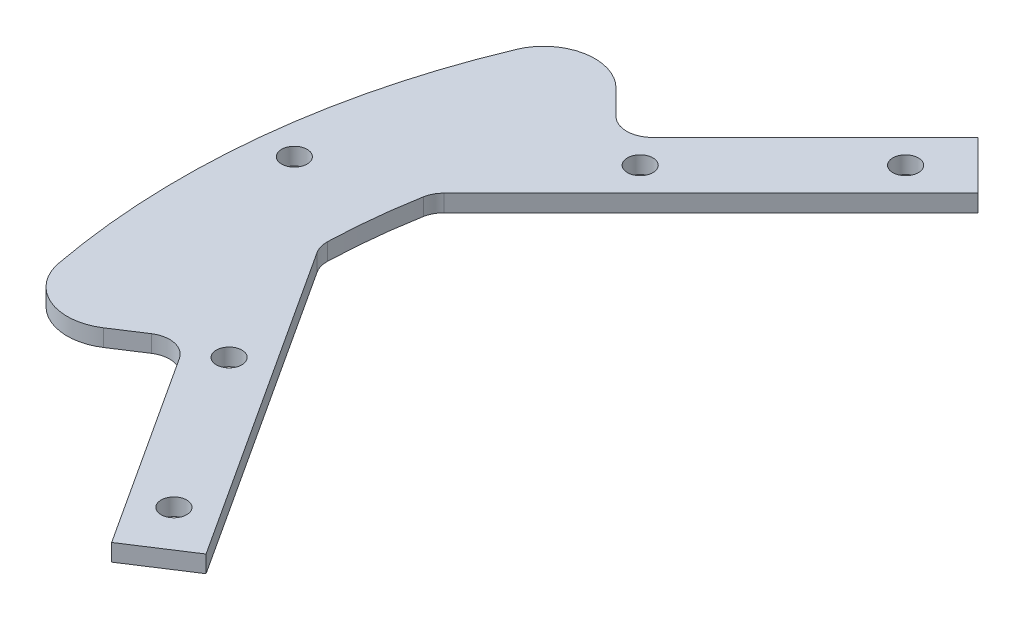
ISO-10303-21;
HEADER;
FILE_DESCRIPTION(('STEP AP214'),'2;1');
FILE_NAME('part.step','',(''),(''),'','','');
FILE_SCHEMA(('AUTOMOTIVE_DESIGN { 1 0 10303 214 1 1 1 1 }'));
ENDSEC;
DATA;
#1=APPLICATION_CONTEXT('core data for automotive mechanical design processes');
#2=APPLICATION_PROTOCOL_DEFINITION('international standard','automotive_design',2000,#1);
#3=PRODUCT_CONTEXT('',#1,'mechanical');
#4=PRODUCT('Part','Part','',(#3));
#5=PRODUCT_RELATED_PRODUCT_CATEGORY('part','',(#4));
#6=PRODUCT_DEFINITION_FORMATION('','',#4);
#7=PRODUCT_DEFINITION_CONTEXT('part definition',#1,'design');
#8=PRODUCT_DEFINITION('design','',#6,#7);
#9=PRODUCT_DEFINITION_SHAPE('','',#8);
#10=(LENGTH_UNIT() NAMED_UNIT(*) SI_UNIT(.MILLI.,.METRE.));
#11=(NAMED_UNIT(*) PLANE_ANGLE_UNIT() SI_UNIT($,.RADIAN.));
#12=(NAMED_UNIT(*) SI_UNIT($,.STERADIAN.) SOLID_ANGLE_UNIT());
#13=UNCERTAINTY_MEASURE_WITH_UNIT(LENGTH_MEASURE(1.E-05),#10,'distance_accuracy_value','');
#14=(GEOMETRIC_REPRESENTATION_CONTEXT(3) GLOBAL_UNCERTAINTY_ASSIGNED_CONTEXT((#13)) GLOBAL_UNIT_ASSIGNED_CONTEXT((#10,
#11,#12)) REPRESENTATION_CONTEXT('',''));
#15=CARTESIAN_POINT('',(0.,0.,0.));
#16=DIRECTION('',(0.,0.,1.));
#17=DIRECTION('',(1.,0.,0.));
#18=AXIS2_PLACEMENT_3D('',#15,#16,#17);
#19=CARTESIAN_POINT('',(0.,2.,0.));
#20=DIRECTION('',(0.,1.,0.));
#21=DIRECTION('',(0.,0.,1.));
#22=AXIS2_PLACEMENT_3D('',#19,#20,#21);
#23=PLANE('',#22);
#24=CARTESIAN_POINT('',(-80.5343611063032,2.,-8.8849193777506));
#25=DIRECTION('',(0.,1.,0.));
#26=DIRECTION('',(0.,0.,1.));
#27=AXIS2_PLACEMENT_3D('',#24,#25,#26);
#28=CIRCLE('',#27,1.5);
#29=CARTESIAN_POINT('',(-80.5343611063032,2.,-7.3849193777506));
#30=VERTEX_POINT('',#29);
#31=EDGE_CURVE('E550',#30,#30,#28,.T.);
#32=ORIENTED_EDGE('',*,*,#31,.F.);
#33=EDGE_LOOP('',(#32));
#34=FACE_BOUND('',#33,.T.);
#35=CARTESIAN_POINT('',(-51.9975752126165,2.,33.7676201709314));
#36=DIRECTION('',(0.,1.,0.));
#37=DIRECTION('',(0.,0.,1.));
#38=AXIS2_PLACEMENT_3D('',#35,#36,#37);
#39=CIRCLE('',#38,1.5);
#40=CARTESIAN_POINT('',(-51.9975752126165,2.,35.2676201709314));
#41=VERTEX_POINT('',#40);
#42=EDGE_CURVE('E533',#41,#41,#39,.T.);
#43=ORIENTED_EDGE('',*,*,#42,.F.);
#44=EDGE_LOOP('',(#43));
#45=FACE_BOUND('',#44,.T.);
#46=CARTESIAN_POINT('',(-43.8406204335662,2.,-43.8406204335657));
#47=DIRECTION('',(0.,1.,0.));
#48=DIRECTION('',(0.,0.,1.));
#49=AXIS2_PLACEMENT_3D('',#46,#47,#48);
#50=CIRCLE('',#49,1.5);
#51=CARTESIAN_POINT('',(-43.8406204335662,2.,-42.3406204335657));
#52=VERTEX_POINT('',#51);
#53=EDGE_CURVE('E192',#52,#52,#50,.T.);
#54=ORIENTED_EDGE('',*,*,#53,.F.);
#55=EDGE_LOOP('',(#54));
#56=FACE_BOUND('',#55,.T.);
#57=DIRECTION('',(-0.707106781186544,0.,0.707106781186551));
#58=VECTOR('',#57,1.);
#59=CARTESIAN_POINT('',(-63.6396103067894,2.,-29.6984848098347));
#60=LINE('',#59,#58);
#61=CARTESIAN_POINT('',(-42.4264068711931,2.,-50.9116882454312));
#62=VERTEX_POINT('',#61);
#63=CARTESIAN_POINT('',(-61.5182899632298,2.,-31.8198051533943));
#64=VERTEX_POINT('',#63);
#65=EDGE_CURVE('E183',#62,#64,#60,.T.);
#66=ORIENTED_EDGE('',*,*,#65,.T.);
#67=CARTESIAN_POINT('',(-63.6396103067894,2.,-33.941125496954));
#68=DIRECTION('',(0.,1.,0.));
#69=DIRECTION('',(0.,0.,1.));
#70=AXIS2_PLACEMENT_3D('',#67,#68,#69);
#71=CIRCLE('',#70,3.);
#72=CARTESIAN_POINT('',(-65.7609306503491,2.,-31.8198051533943));
#73=VERTEX_POINT('',#72);
#74=EDGE_CURVE('E266',#64,#73,#71,.F.);
#75=ORIENTED_EDGE('',*,*,#74,.T.);
#76=DIRECTION('',(-0.707106781186552,0.,-0.707106781186543));
#77=VECTOR('',#76,1.);
#78=CARTESIAN_POINT('',(-74.6290400089809,2.,-40.687914512026));
#79=LINE('',#78,#77);
#80=CARTESIAN_POINT('',(-68.6474434592942,2.,-34.7063179623394));
#81=VERTEX_POINT('',#80);
#82=EDGE_CURVE('E185',#73,#81,#79,.T.);
#83=ORIENTED_EDGE('',*,*,#82,.T.);
#84=CARTESIAN_POINT('',(-72.8900841464135,2.,-30.4636772752201));
#85=DIRECTION('',(0.,1.,0.));
#86=DIRECTION('',(0.,0.,1.));
#87=AXIS2_PLACEMENT_3D('',#84,#85,#86);
#88=CIRCLE('',#87,6.);
#89=CARTESIAN_POINT('',(-78.4260399043689,2.,-32.7773742834647));
#90=VERTEX_POINT('',#89);
#91=EDGE_CURVE('E233',#81,#90,#88,.T.);
#92=ORIENTED_EDGE('',*,*,#91,.T.);
#93=CARTESIAN_POINT('',(0.,2.,0.));
#94=DIRECTION('',(0.,1.,0.));
#95=DIRECTION('',(0.,0.,1.));
#96=AXIS2_PLACEMENT_3D('',#93,#94,#95);
#97=CIRCLE('',#96,85.);
#98=CARTESIAN_POINT('',(-83.5270420753539,2.,15.7554194530665));
#99=VERTEX_POINT('',#98);
#100=EDGE_CURVE('E212',#90,#99,#97,.T.);
#101=ORIENTED_EDGE('',*,*,#100,.T.);
#102=CARTESIAN_POINT('',(-77.6310155759171,2.,14.6432721975559));
#103=DIRECTION('',(0.,1.,0.));
#104=DIRECTION('',(0.,0.,1.));
#105=AXIS2_PLACEMENT_3D('',#102,#103,#104);
#106=CIRCLE('',#105,6.);
#107=CARTESIAN_POINT('',(-74.363181365827,2.,19.6752956052285));
#108=VERTEX_POINT('',#107);
#109=EDGE_CURVE('E231',#99,#108,#106,.T.);
#110=ORIENTED_EDGE('',*,*,#109,.T.);
#111=DIRECTION('',(0.838670567945427,0.,-0.544639035015022));
#112=VECTOR('',#111,1.);
#113=CARTESIAN_POINT('',(-68.4235943247587,2.,15.8180826803013));
#114=LINE('',#113,#112);
#115=CARTESIAN_POINT('',(-70.939606028595,2.,17.4519997853463));
#116=VERTEX_POINT('',#115);
#117=EDGE_CURVE('E157',#108,#116,#114,.T.);
#118=ORIENTED_EDGE('',*,*,#117,.T.);
#119=CARTESIAN_POINT('',(-69.3056889235499,2.,19.9680114891826));
#120=DIRECTION('',(0.,1.,0.));
#121=DIRECTION('',(0.,0.,1.));
#122=AXIS2_PLACEMENT_3D('',#119,#120,#121);
#123=CIRCLE('',#122,3.);
#124=CARTESIAN_POINT('',(-66.7896772197137,2.,18.3340943841376));
#125=VERTEX_POINT('',#124);
#126=EDGE_CURVE('E11',#116,#125,#123,.F.);
#127=ORIENTED_EDGE('',*,*,#126,.T.);
#128=DIRECTION('',(0.544639035015023,0.,0.838670567945427));
#129=VECTOR('',#128,1.);
#130=CARTESIAN_POINT('',(-52.0844232743081,2.,40.978199718664));
#131=LINE('',#130,#129);
#132=CARTESIAN_POINT('',(-52.0844232743081,2.,40.978199718664));
#133=VERTEX_POINT('',#132);
#134=EDGE_CURVE('E145',#125,#133,#131,.T.);
#135=ORIENTED_EDGE('',*,*,#134,.T.);
#136=DIRECTION('',(0.838670567945427,0.,-0.544639035015022));
#137=VECTOR('',#136,1.);
#138=CARTESIAN_POINT('',(-45.3750587307446,2.,36.6210874385439));
#139=LINE('',#138,#137);
#140=CARTESIAN_POINT('',(-45.3750587307446,2.,36.6210874385439));
#141=VERTEX_POINT('',#140);
#142=EDGE_CURVE('E151',#133,#141,#139,.T.);
#143=ORIENTED_EDGE('',*,*,#142,.T.);
#144=DIRECTION('',(-0.544639035015023,0.,-0.838670567945426));
#145=VECTOR('',#144,1.);
#146=CARTESIAN_POINT('',(-69.9882966174528,2.,-1.27997522923208));
#147=LINE('',#146,#145);
#148=CARTESIAN_POINT('',(-69.4820094592601,2.,-0.500361372701874));
#149=VERTEX_POINT('',#148);
#150=EDGE_CURVE('E171',#141,#149,#147,.T.);
#151=ORIENTED_EDGE('',*,*,#150,.T.);
#152=CARTESIAN_POINT('',(-66.9659977554238,2.,-2.13427847774693));
#153=DIRECTION('',(0.,1.,0.));
#154=DIRECTION('',(0.,0.,1.));
#155=AXIS2_PLACEMENT_3D('',#152,#153,#154);
#156=CIRCLE('',#155,3.);
#157=CARTESIAN_POINT('',(-69.9644752668607,2.,-2.22984318570575));
#158=VERTEX_POINT('',#157);
#159=EDGE_CURVE('E258',#149,#158,#156,.F.);
#160=ORIENTED_EDGE('',*,*,#159,.T.);
#161=CARTESIAN_POINT('',(0.,2.,0.));
#162=DIRECTION('',(0.,-1.,0.));
#163=DIRECTION('',(0.,0.,1.));
#164=AXIS2_PLACEMENT_3D('',#161,#162,#163);
#165=CIRCLE('',#164,70.);
#166=CARTESIAN_POINT('',(-68.899194085878,2.,-12.3653165877995));
#167=VERTEX_POINT('',#166);
#168=EDGE_CURVE('E173',#158,#167,#165,.T.);
#169=ORIENTED_EDGE('',*,*,#168,.T.);
#170=CARTESIAN_POINT('',(-65.9463714821975,2.,-11.8353744483224));
#171=DIRECTION('',(0.,1.,0.));
#172=DIRECTION('',(0.,0.,1.));
#173=AXIS2_PLACEMENT_3D('',#170,#171,#172);
#174=CIRCLE('',#173,3.);
#175=CARTESIAN_POINT('',(-68.0676918257572,2.,-13.956694791882));
#176=VERTEX_POINT('',#175);
#177=EDGE_CURVE('E262',#167,#176,#174,.F.);
#178=ORIENTED_EDGE('',*,*,#177,.T.);
#179=DIRECTION('',(0.707106781186543,0.,-0.707106781186551));
#180=VECTOR('',#179,1.);
#181=CARTESIAN_POINT('',(-36.7695526217007,2.,-45.2548339959388));
#182=LINE('',#181,#180);
#183=CARTESIAN_POINT('',(-36.7695526217007,2.,-45.2548339959388));
#184=VERTEX_POINT('',#183);
#185=EDGE_CURVE('E179',#176,#184,#182,.T.);
#186=ORIENTED_EDGE('',*,*,#185,.T.);
#187=DIRECTION('',(-0.707106781186551,0.,-0.707106781186544));
#188=VECTOR('',#187,1.);
#189=CARTESIAN_POINT('',(-42.4264068711931,2.,-50.9116882454312));
#190=LINE('',#189,#188);
#191=EDGE_CURVE('E181',#184,#62,#190,.T.);
#192=ORIENTED_EDGE('',*,*,#191,.T.);
#193=EDGE_LOOP('',(#66,#75,#83,#92,#101,#110,#118,#127,#135,#143,#151,#160,#169,#178,#186,#192));
#194=FACE_BOUND('',#193,.T.);
#195=CARTESIAN_POINT('',(-59.3969696196702,2.,-28.2842712474616));
#196=DIRECTION('',(0.,1.,0.));
#197=DIRECTION('',(0.,0.,1.));
#198=AXIS2_PLACEMENT_3D('',#195,#196,#197);
#199=CIRCLE('',#198,1.5);
#200=CARTESIAN_POINT('',(-59.3969696196702,2.,-26.7842712474616));
#201=VERTEX_POINT('',#200);
#202=EDGE_CURVE('E527',#201,#201,#199,.T.);
#203=ORIENTED_EDGE('',*,*,#202,.F.);
#204=EDGE_LOOP('',(#203));
#205=FACE_BOUND('',#204,.T.);
#206=CARTESIAN_POINT('',(-63.979633982947,2.,15.316867676132));
#207=DIRECTION('',(0.,1.,0.));
#208=DIRECTION('',(0.,0.,1.));
#209=AXIS2_PLACEMENT_3D('',#206,#207,#208);
#210=CIRCLE('',#209,1.5);
#211=CARTESIAN_POINT('',(-63.979633982947,2.,16.816867676132));
#212=VERTEX_POINT('',#211);
#213=EDGE_CURVE('E539',#212,#212,#210,.T.);
#214=ORIENTED_EDGE('',*,*,#213,.F.);
#215=EDGE_LOOP('',(#214));
#216=FACE_BOUND('',#215,.T.);
#217=ADVANCED_FACE('F33',(#34,#45,#56,#194,#205,#216),#23,.T.);
#218=CARTESIAN_POINT('',(0.,0.,0.));
#219=DIRECTION('',(0.,1.,0.));
#220=DIRECTION('',(0.,0.,1.));
#221=AXIS2_PLACEMENT_3D('',#218,#219,#220);
#222=PLANE('',#221);
#223=CARTESIAN_POINT('',(-80.5343611063032,0.,-8.8849193777506));
#224=DIRECTION('',(0.,1.,0.));
#225=DIRECTION('',(0.,0.,1.));
#226=AXIS2_PLACEMENT_3D('',#223,#224,#225);
#227=CIRCLE('',#226,1.5);
#228=CARTESIAN_POINT('',(-80.5343611063032,0.,-7.3849193777506));
#229=VERTEX_POINT('',#228);
#230=EDGE_CURVE('E545',#229,#229,#227,.T.);
#231=ORIENTED_EDGE('',*,*,#230,.T.);
#232=EDGE_LOOP('',(#231));
#233=FACE_BOUND('',#232,.T.);
#234=CARTESIAN_POINT('',(-51.9975752126165,0.,33.7676201709314));
#235=DIRECTION('',(0.,1.,0.));
#236=DIRECTION('',(0.,0.,1.));
#237=AXIS2_PLACEMENT_3D('',#234,#235,#236);
#238=CIRCLE('',#237,1.5);
#239=CARTESIAN_POINT('',(-51.9975752126165,0.,35.2676201709314));
#240=VERTEX_POINT('',#239);
#241=EDGE_CURVE('E536',#240,#240,#238,.T.);
#242=ORIENTED_EDGE('',*,*,#241,.T.);
#243=EDGE_LOOP('',(#242));
#244=FACE_BOUND('',#243,.T.);
#245=CARTESIAN_POINT('',(-43.8406204335662,0.,-43.8406204335657));
#246=DIRECTION('',(0.,1.,0.));
#247=DIRECTION('',(0.,0.,1.));
#248=AXIS2_PLACEMENT_3D('',#245,#246,#247);
#249=CIRCLE('',#248,1.5);
#250=CARTESIAN_POINT('',(-43.8406204335662,0.,-42.3406204335657));
#251=VERTEX_POINT('',#250);
#252=EDGE_CURVE('E524',#251,#251,#249,.T.);
#253=ORIENTED_EDGE('',*,*,#252,.T.);
#254=EDGE_LOOP('',(#253));
#255=FACE_BOUND('',#254,.T.);
#256=CARTESIAN_POINT('',(0.,0.,0.));
#257=DIRECTION('',(0.,1.,0.));
#258=DIRECTION('',(0.,0.,1.));
#259=AXIS2_PLACEMENT_3D('',#256,#257,#258);
#260=CIRCLE('',#259,85.);
#261=CARTESIAN_POINT('',(-78.4260399043689,0.,-32.7773742834647));
#262=VERTEX_POINT('',#261);
#263=CARTESIAN_POINT('',(-83.5270420753539,0.,15.7554194530665));
#264=VERTEX_POINT('',#263);
#265=EDGE_CURVE('E188',#262,#264,#260,.T.);
#266=ORIENTED_EDGE('',*,*,#265,.F.);
#267=CARTESIAN_POINT('',(-72.8900841464135,0.,-30.4636772752201));
#268=DIRECTION('',(0.,1.,0.));
#269=DIRECTION('',(0.,0.,1.));
#270=AXIS2_PLACEMENT_3D('',#267,#268,#269);
#271=CIRCLE('',#270,6.);
#272=CARTESIAN_POINT('',(-68.6474434592942,0.,-34.7063179623394));
#273=VERTEX_POINT('',#272);
#274=EDGE_CURVE('E225',#262,#273,#271,.F.);
#275=ORIENTED_EDGE('',*,*,#274,.T.);
#276=DIRECTION('',(-0.707106781186552,0.,-0.707106781186543));
#277=VECTOR('',#276,1.);
#278=CARTESIAN_POINT('',(-74.6290400089809,0.,-40.687914512026));
#279=LINE('',#278,#277);
#280=CARTESIAN_POINT('',(-65.7609306503491,0.,-31.8198051533943));
#281=VERTEX_POINT('',#280);
#282=EDGE_CURVE('E210',#281,#273,#279,.T.);
#283=ORIENTED_EDGE('',*,*,#282,.F.);
#284=CARTESIAN_POINT('',(-63.6396103067894,0.,-33.941125496954));
#285=DIRECTION('',(0.,1.,0.));
#286=DIRECTION('',(0.,0.,1.));
#287=AXIS2_PLACEMENT_3D('',#284,#285,#286);
#288=CIRCLE('',#287,3.);
#289=CARTESIAN_POINT('',(-61.5182899632298,0.,-31.8198051533943));
#290=VERTEX_POINT('',#289);
#291=EDGE_CURVE('E264',#281,#290,#288,.T.);
#292=ORIENTED_EDGE('',*,*,#291,.T.);
#293=DIRECTION('',(-0.707106781186544,0.,0.707106781186551));
#294=VECTOR('',#293,1.);
#295=CARTESIAN_POINT('',(-63.6396103067894,0.,-29.6984848098347));
#296=LINE('',#295,#294);
#297=CARTESIAN_POINT('',(-42.4264068711931,0.,-50.9116882454312));
#298=VERTEX_POINT('',#297);
#299=EDGE_CURVE('E207',#298,#290,#296,.T.);
#300=ORIENTED_EDGE('',*,*,#299,.F.);
#301=DIRECTION('',(-0.707106781186551,0.,-0.707106781186544));
#302=VECTOR('',#301,1.);
#303=CARTESIAN_POINT('',(-42.4264068711931,0.,-50.9116882454312));
#304=LINE('',#303,#302);
#305=CARTESIAN_POINT('',(-36.7695526217007,0.,-45.2548339959388));
#306=VERTEX_POINT('',#305);
#307=EDGE_CURVE('E205',#306,#298,#304,.T.);
#308=ORIENTED_EDGE('',*,*,#307,.F.);
#309=DIRECTION('',(0.707106781186543,0.,-0.707106781186551));
#310=VECTOR('',#309,1.);
#311=CARTESIAN_POINT('',(-36.7695526217007,0.,-45.2548339959388));
#312=LINE('',#311,#310);
#313=CARTESIAN_POINT('',(-68.0676918257572,0.,-13.956694791882));
#314=VERTEX_POINT('',#313);
#315=EDGE_CURVE('E203',#314,#306,#312,.T.);
#316=ORIENTED_EDGE('',*,*,#315,.F.);
#317=CARTESIAN_POINT('',(-65.9463714821975,0.,-11.8353744483224));
#318=DIRECTION('',(0.,1.,0.));
#319=DIRECTION('',(0.,0.,1.));
#320=AXIS2_PLACEMENT_3D('',#317,#318,#319);
#321=CIRCLE('',#320,3.);
#322=CARTESIAN_POINT('',(-68.899194085878,0.,-12.3653165877995));
#323=VERTEX_POINT('',#322);
#324=EDGE_CURVE('E260',#314,#323,#321,.T.);
#325=ORIENTED_EDGE('',*,*,#324,.T.);
#326=CARTESIAN_POINT('',(0.,0.,0.));
#327=DIRECTION('',(0.,-1.,0.));
#328=DIRECTION('',(0.,0.,1.));
#329=AXIS2_PLACEMENT_3D('',#326,#327,#328);
#330=CIRCLE('',#329,70.);
#331=CARTESIAN_POINT('',(-69.9644752668607,0.,-2.22984318570575));
#332=VERTEX_POINT('',#331);
#333=EDGE_CURVE('E200',#332,#323,#330,.T.);
#334=ORIENTED_EDGE('',*,*,#333,.F.);
#335=CARTESIAN_POINT('',(-66.9659977554238,0.,-2.13427847774693));
#336=DIRECTION('',(0.,1.,0.));
#337=DIRECTION('',(0.,0.,1.));
#338=AXIS2_PLACEMENT_3D('',#335,#336,#337);
#339=CIRCLE('',#338,3.);
#340=CARTESIAN_POINT('',(-69.4820094592601,0.,-0.500361372701874));
#341=VERTEX_POINT('',#340);
#342=EDGE_CURVE('E256',#332,#341,#339,.T.);
#343=ORIENTED_EDGE('',*,*,#342,.T.);
#344=DIRECTION('',(-0.544639035015023,0.,-0.838670567945426));
#345=VECTOR('',#344,1.);
#346=CARTESIAN_POINT('',(-69.9882966174528,0.,-1.27997522923208));
#347=LINE('',#346,#345);
#348=CARTESIAN_POINT('',(-45.3750587307446,0.,36.6210874385439));
#349=VERTEX_POINT('',#348);
#350=EDGE_CURVE('E197',#349,#341,#347,.T.);
#351=ORIENTED_EDGE('',*,*,#350,.F.);
#352=DIRECTION('',(0.838670567945427,0.,-0.544639035015022));
#353=VECTOR('',#352,1.);
#354=CARTESIAN_POINT('',(-45.3750587307446,0.,36.6210874385439));
#355=LINE('',#354,#353);
#356=CARTESIAN_POINT('',(-52.0844232743081,0.,40.978199718664));
#357=VERTEX_POINT('',#356);
#358=EDGE_CURVE('E195',#357,#349,#355,.T.);
#359=ORIENTED_EDGE('',*,*,#358,.F.);
#360=DIRECTION('',(0.544639035015023,0.,0.838670567945427));
#361=VECTOR('',#360,1.);
#362=CARTESIAN_POINT('',(-52.0844232743081,0.,40.978199718664));
#363=LINE('',#362,#361);
#364=CARTESIAN_POINT('',(-66.7896772197137,0.,18.3340943841376));
#365=VERTEX_POINT('',#364);
#366=EDGE_CURVE('E162',#365,#357,#363,.T.);
#367=ORIENTED_EDGE('',*,*,#366,.F.);
#368=CARTESIAN_POINT('',(-69.3056889235499,0.,19.9680114891826));
#369=DIRECTION('',(0.,1.,0.));
#370=DIRECTION('',(0.,0.,1.));
#371=AXIS2_PLACEMENT_3D('',#368,#369,#370);
#372=CIRCLE('',#371,3.);
#373=CARTESIAN_POINT('',(-70.939606028595,0.,17.4519997853463));
#374=VERTEX_POINT('',#373);
#375=EDGE_CURVE('E41',#365,#374,#372,.T.);
#376=ORIENTED_EDGE('',*,*,#375,.T.);
#377=DIRECTION('',(0.838670567945427,0.,-0.544639035015022));
#378=VECTOR('',#377,1.);
#379=CARTESIAN_POINT('',(-68.4235943247587,0.,15.8180826803013));
#380=LINE('',#379,#378);
#381=CARTESIAN_POINT('',(-74.363181365827,0.,19.6752956052285));
#382=VERTEX_POINT('',#381);
#383=EDGE_CURVE('E191',#382,#374,#380,.T.);
#384=ORIENTED_EDGE('',*,*,#383,.F.);
#385=CARTESIAN_POINT('',(-77.6310155759171,0.,14.6432721975559));
#386=DIRECTION('',(0.,1.,0.));
#387=DIRECTION('',(0.,0.,1.));
#388=AXIS2_PLACEMENT_3D('',#385,#386,#387);
#389=CIRCLE('',#388,6.);
#390=EDGE_CURVE('E223',#382,#264,#389,.F.);
#391=ORIENTED_EDGE('',*,*,#390,.T.);
#392=EDGE_LOOP('',(#266,#275,#283,#292,#300,#308,#316,#325,#334,#343,#351,#359,#367,#376,#384,#391));
#393=FACE_BOUND('',#392,.T.);
#394=CARTESIAN_POINT('',(-59.3969696196702,0.,-28.2842712474616));
#395=DIRECTION('',(0.,1.,0.));
#396=DIRECTION('',(0.,0.,1.));
#397=AXIS2_PLACEMENT_3D('',#394,#395,#396);
#398=CIRCLE('',#397,1.5);
#399=CARTESIAN_POINT('',(-59.3969696196702,0.,-26.7842712474616));
#400=VERTEX_POINT('',#399);
#401=EDGE_CURVE('E530',#400,#400,#398,.T.);
#402=ORIENTED_EDGE('',*,*,#401,.T.);
#403=EDGE_LOOP('',(#402));
#404=FACE_BOUND('',#403,.T.);
#405=CARTESIAN_POINT('',(-63.979633982947,0.,15.316867676132));
#406=DIRECTION('',(0.,1.,0.));
#407=DIRECTION('',(0.,0.,1.));
#408=AXIS2_PLACEMENT_3D('',#405,#406,#407);
#409=CIRCLE('',#408,1.5);
#410=CARTESIAN_POINT('',(-63.979633982947,0.,16.816867676132));
#411=VERTEX_POINT('',#410);
#412=EDGE_CURVE('E542',#411,#411,#409,.T.);
#413=ORIENTED_EDGE('',*,*,#412,.T.);
#414=EDGE_LOOP('',(#413));
#415=FACE_BOUND('',#414,.T.);
#416=ADVANCED_FACE('F281',(#233,#244,#255,#393,#404,#415),#222,.F.);
#417=CARTESIAN_POINT('',(0.,2.,0.));
#418=DIRECTION('',(0.,-1.,0.));
#419=DIRECTION('',(0.,0.,-1.));
#420=AXIS2_PLACEMENT_3D('',#417,#418,#419);
#421=CYLINDRICAL_SURFACE('',#420,85.);
#422=ORIENTED_EDGE('',*,*,#100,.F.);
#423=DIRECTION('',(0.,-1.,0.));
#424=VECTOR('',#423,1.);
#425=CARTESIAN_POINT('',(-78.426039904369,2.,-32.7773742834647));
#426=LINE('',#425,#424);
#427=EDGE_CURVE('E220',#90,#262,#426,.T.);
#428=ORIENTED_EDGE('',*,*,#427,.T.);
#429=ORIENTED_EDGE('',*,*,#265,.T.);
#430=DIRECTION('',(0.,-1.,0.));
#431=VECTOR('',#430,1.);
#432=CARTESIAN_POINT('',(-83.5270420753539,2.,15.7554194530665));
#433=LINE('',#432,#431);
#434=EDGE_CURVE('E165',#264,#99,#433,.F.);
#435=ORIENTED_EDGE('',*,*,#434,.T.);
#436=EDGE_LOOP('',(#422,#428,#429,#435));
#437=FACE_BOUND('',#436,.T.);
#438=ADVANCED_FACE('F326',(#437),#421,.T.);
#439=CARTESIAN_POINT('',(-68.4235943247587,2.,15.8180826803013));
#440=DIRECTION('',(-0.544639035015022,0.,-0.838670567945427));
#441=DIRECTION('',(-0.838670567945427,0.,0.544639035015022));
#442=AXIS2_PLACEMENT_3D('',#439,#440,#441);
#443=PLANE('',#442);
#444=ORIENTED_EDGE('',*,*,#383,.T.);
#445=DIRECTION('',(0.,-1.,0.));
#446=VECTOR('',#445,1.);
#447=CARTESIAN_POINT('',(-70.939606028595,2.,17.4519997853463));
#448=LINE('',#447,#446);
#449=EDGE_CURVE('E54',#374,#116,#448,.F.);
#450=ORIENTED_EDGE('',*,*,#449,.T.);
#451=ORIENTED_EDGE('',*,*,#117,.F.);
#452=DIRECTION('',(0.,-1.,0.));
#453=VECTOR('',#452,1.);
#454=CARTESIAN_POINT('',(-74.363181365827,2.,19.6752956052285));
#455=LINE('',#454,#453);
#456=EDGE_CURVE('E235',#108,#382,#455,.T.);
#457=ORIENTED_EDGE('',*,*,#456,.T.);
#458=EDGE_LOOP('',(#444,#450,#451,#457));
#459=FACE_BOUND('',#458,.T.);
#460=ADVANCED_FACE('F455',(#459),#443,.F.);
#461=CARTESIAN_POINT('',(-52.0844232743081,2.,40.978199718664));
#462=DIRECTION('',(0.838670567945427,0.,-0.544639035015023));
#463=DIRECTION('',(-0.544639035015023,0.,-0.838670567945427));
#464=AXIS2_PLACEMENT_3D('',#461,#462,#463);
#465=PLANE('',#464);
#466=ORIENTED_EDGE('',*,*,#134,.F.);
#467=DIRECTION('',(0.,-1.,0.));
#468=VECTOR('',#467,1.);
#469=CARTESIAN_POINT('',(-66.7896772197137,0.,18.3340943841376));
#470=LINE('',#469,#468);
#471=EDGE_CURVE('E253',#125,#365,#470,.T.);
#472=ORIENTED_EDGE('',*,*,#471,.T.);
#473=ORIENTED_EDGE('',*,*,#366,.T.);
#474=DIRECTION('',(0.,-1.,0.));
#475=VECTOR('',#474,1.);
#476=CARTESIAN_POINT('',(-52.0844232743081,2.,40.978199718664));
#477=LINE('',#476,#475);
#478=EDGE_CURVE('E160',#133,#357,#477,.T.);
#479=ORIENTED_EDGE('',*,*,#478,.F.);
#480=EDGE_LOOP('',(#466,#472,#473,#479));
#481=FACE_BOUND('',#480,.T.);
#482=ADVANCED_FACE('F161',(#481),#465,.F.);
#483=CARTESIAN_POINT('',(-45.3750587307446,2.,36.6210874385439));
#484=DIRECTION('',(-0.544639035015022,0.,-0.838670567945427));
#485=DIRECTION('',(-0.838670567945427,0.,0.544639035015022));
#486=AXIS2_PLACEMENT_3D('',#483,#484,#485);
#487=PLANE('',#486);
#488=ORIENTED_EDGE('',*,*,#358,.T.);
#489=DIRECTION('',(0.,-1.,0.));
#490=VECTOR('',#489,1.);
#491=CARTESIAN_POINT('',(-45.3750587307446,2.,36.6210874385439));
#492=LINE('',#491,#490);
#493=EDGE_CURVE('E166',#141,#349,#492,.T.);
#494=ORIENTED_EDGE('',*,*,#493,.F.);
#495=ORIENTED_EDGE('',*,*,#142,.F.);
#496=ORIENTED_EDGE('',*,*,#478,.T.);
#497=EDGE_LOOP('',(#488,#494,#495,#496));
#498=FACE_BOUND('',#497,.T.);
#499=ADVANCED_FACE('F168',(#498),#487,.F.);
#500=CARTESIAN_POINT('',(-69.9882966174528,2.,-1.27997522923208));
#501=DIRECTION('',(-0.838670567945427,0.,0.544639035015023));
#502=DIRECTION('',(0.544639035015023,0.,0.838670567945426));
#503=AXIS2_PLACEMENT_3D('',#500,#501,#502);
#504=PLANE('',#503);
#505=ORIENTED_EDGE('',*,*,#350,.T.);
#506=DIRECTION('',(0.,1.,0.));
#507=VECTOR('',#506,1.);
#508=CARTESIAN_POINT('',(-69.4820094592601,2.,-0.500361372701873));
#509=LINE('',#508,#507);
#510=EDGE_CURVE('E243',#341,#149,#509,.T.);
#511=ORIENTED_EDGE('',*,*,#510,.T.);
#512=ORIENTED_EDGE('',*,*,#150,.F.);
#513=ORIENTED_EDGE('',*,*,#493,.T.);
#514=EDGE_LOOP('',(#505,#511,#512,#513));
#515=FACE_BOUND('',#514,.T.);
#516=ADVANCED_FACE('F311',(#515),#504,.F.);
#517=CARTESIAN_POINT('',(0.,2.,0.));
#518=DIRECTION('',(0.,-1.,0.));
#519=DIRECTION('',(0.,0.,-1.));
#520=AXIS2_PLACEMENT_3D('',#517,#518,#519);
#521=CYLINDRICAL_SURFACE('',#520,70.);
#522=ORIENTED_EDGE('',*,*,#168,.F.);
#523=DIRECTION('',(0.,-1.,0.));
#524=VECTOR('',#523,1.);
#525=CARTESIAN_POINT('',(-69.9644752668607,2.,-2.22984318570575));
#526=LINE('',#525,#524);
#527=EDGE_CURVE('E240',#158,#332,#526,.T.);
#528=ORIENTED_EDGE('',*,*,#527,.T.);
#529=ORIENTED_EDGE('',*,*,#333,.T.);
#530=DIRECTION('',(0.,-1.,0.));
#531=VECTOR('',#530,1.);
#532=CARTESIAN_POINT('',(-68.8991940858781,2.,-12.3653165877995));
#533=LINE('',#532,#531);
#534=EDGE_CURVE('E238',#323,#167,#533,.F.);
#535=ORIENTED_EDGE('',*,*,#534,.T.);
#536=EDGE_LOOP('',(#522,#528,#529,#535));
#537=FACE_BOUND('',#536,.T.);
#538=ADVANCED_FACE('F303',(#537),#521,.F.);
#539=CARTESIAN_POINT('',(-36.7695526217007,2.,-45.2548339959388));
#540=DIRECTION('',(-0.707106781186552,0.,-0.707106781186543));
#541=DIRECTION('',(-0.707106781186543,0.,0.707106781186552));
#542=AXIS2_PLACEMENT_3D('',#539,#540,#541);
#543=PLANE('',#542);
#544=ORIENTED_EDGE('',*,*,#185,.F.);
#545=DIRECTION('',(0.,1.,0.));
#546=VECTOR('',#545,1.);
#547=CARTESIAN_POINT('',(-68.0676918257572,0.,-13.956694791882));
#548=LINE('',#547,#546);
#549=EDGE_CURVE('E245',#176,#314,#548,.F.);
#550=ORIENTED_EDGE('',*,*,#549,.T.);
#551=ORIENTED_EDGE('',*,*,#315,.T.);
#552=DIRECTION('',(0.,-1.,0.));
#553=VECTOR('',#552,1.);
#554=CARTESIAN_POINT('',(-36.7695526217007,2.,-45.2548339959388));
#555=LINE('',#554,#553);
#556=EDGE_CURVE('E215',#184,#306,#555,.T.);
#557=ORIENTED_EDGE('',*,*,#556,.F.);
#558=EDGE_LOOP('',(#544,#550,#551,#557));
#559=FACE_BOUND('',#558,.T.);
#560=ADVANCED_FACE('F295',(#559),#543,.F.);
#561=CARTESIAN_POINT('',(-42.4264068711931,2.,-50.9116882454312));
#562=DIRECTION('',(-0.707106781186544,0.,0.707106781186552));
#563=DIRECTION('',(0.707106781186551,0.,0.707106781186544));
#564=AXIS2_PLACEMENT_3D('',#561,#562,#563);
#565=PLANE('',#564);
#566=ORIENTED_EDGE('',*,*,#307,.T.);
#567=DIRECTION('',(0.,-1.,0.));
#568=VECTOR('',#567,1.);
#569=CARTESIAN_POINT('',(-42.4264068711931,2.,-50.9116882454312));
#570=LINE('',#569,#568);
#571=EDGE_CURVE('E187',#62,#298,#570,.T.);
#572=ORIENTED_EDGE('',*,*,#571,.F.);
#573=ORIENTED_EDGE('',*,*,#191,.F.);
#574=ORIENTED_EDGE('',*,*,#556,.T.);
#575=EDGE_LOOP('',(#566,#572,#573,#574));
#576=FACE_BOUND('',#575,.T.);
#577=ADVANCED_FACE('F289',(#576),#565,.F.);
#578=CARTESIAN_POINT('',(-63.6396103067894,2.,-29.6984848098347));
#579=DIRECTION('',(0.707106781186551,0.,0.707106781186544));
#580=DIRECTION('',(0.707106781186544,0.,-0.707106781186551));
#581=AXIS2_PLACEMENT_3D('',#578,#579,#580);
#582=PLANE('',#581);
#583=ORIENTED_EDGE('',*,*,#299,.T.);
#584=DIRECTION('',(0.,-1.,0.));
#585=VECTOR('',#584,1.);
#586=CARTESIAN_POINT('',(-61.5182899632298,2.,-31.8198051533943));
#587=LINE('',#586,#585);
#588=EDGE_CURVE('E251',#290,#64,#587,.F.);
#589=ORIENTED_EDGE('',*,*,#588,.T.);
#590=ORIENTED_EDGE('',*,*,#65,.F.);
#591=ORIENTED_EDGE('',*,*,#571,.T.);
#592=EDGE_LOOP('',(#583,#589,#590,#591));
#593=FACE_BOUND('',#592,.T.);
#594=ADVANCED_FACE('F285',(#593),#582,.F.);
#595=CARTESIAN_POINT('',(-74.6290400089809,2.,-40.687914512026));
#596=DIRECTION('',(-0.707106781186543,0.,0.707106781186552));
#597=DIRECTION('',(0.707106781186552,0.,0.707106781186543));
#598=AXIS2_PLACEMENT_3D('',#595,#596,#597);
#599=PLANE('',#598);
#600=ORIENTED_EDGE('',*,*,#82,.F.);
#601=DIRECTION('',(0.,-1.,0.));
#602=VECTOR('',#601,1.);
#603=CARTESIAN_POINT('',(-65.7609306503491,0.,-31.8198051533943));
#604=LINE('',#603,#602);
#605=EDGE_CURVE('E248',#73,#281,#604,.T.);
#606=ORIENTED_EDGE('',*,*,#605,.T.);
#607=ORIENTED_EDGE('',*,*,#282,.T.);
#608=DIRECTION('',(0.,-1.,0.));
#609=VECTOR('',#608,1.);
#610=CARTESIAN_POINT('',(-68.6474434592942,2.,-34.7063179623394));
#611=LINE('',#610,#609);
#612=EDGE_CURVE('E228',#273,#81,#611,.F.);
#613=ORIENTED_EDGE('',*,*,#612,.T.);
#614=EDGE_LOOP('',(#600,#606,#607,#613));
#615=FACE_BOUND('',#614,.T.);
#616=ADVANCED_FACE('F274',(#615),#599,.F.);
#617=CARTESIAN_POINT('',(-43.8406204335662,2.,-43.8406204335657));
#618=DIRECTION('',(0.,-1.,0.));
#619=DIRECTION('',(0.,0.,-1.));
#620=AXIS2_PLACEMENT_3D('',#617,#618,#619);
#621=CYLINDRICAL_SURFACE('',#620,1.5);
#622=ORIENTED_EDGE('',*,*,#53,.T.);
#623=EDGE_LOOP('',(#622));
#624=FACE_BOUND('',#623,.T.);
#625=ORIENTED_EDGE('',*,*,#252,.F.);
#626=EDGE_LOOP('',(#625));
#627=FACE_BOUND('',#626,.T.);
#628=ADVANCED_FACE('F332',(#624,#627),#621,.F.);
#629=CARTESIAN_POINT('',(-59.3969696196702,2.,-28.2842712474616));
#630=DIRECTION('',(0.,-1.,0.));
#631=DIRECTION('',(0.,0.,-1.));
#632=AXIS2_PLACEMENT_3D('',#629,#630,#631);
#633=CYLINDRICAL_SURFACE('',#632,1.5);
#634=ORIENTED_EDGE('',*,*,#202,.T.);
#635=EDGE_LOOP('',(#634));
#636=FACE_BOUND('',#635,.T.);
#637=ORIENTED_EDGE('',*,*,#401,.F.);
#638=EDGE_LOOP('',(#637));
#639=FACE_BOUND('',#638,.T.);
#640=ADVANCED_FACE('F366',(#636,#639),#633,.F.);
#641=CARTESIAN_POINT('',(-51.9975752126165,2.,33.7676201709314));
#642=DIRECTION('',(0.,-1.,0.));
#643=DIRECTION('',(0.,0.,-1.));
#644=AXIS2_PLACEMENT_3D('',#641,#642,#643);
#645=CYLINDRICAL_SURFACE('',#644,1.5);
#646=ORIENTED_EDGE('',*,*,#42,.T.);
#647=EDGE_LOOP('',(#646));
#648=FACE_BOUND('',#647,.T.);
#649=ORIENTED_EDGE('',*,*,#241,.F.);
#650=EDGE_LOOP('',(#649));
#651=FACE_BOUND('',#650,.T.);
#652=ADVANCED_FACE('F373',(#648,#651),#645,.F.);
#653=CARTESIAN_POINT('',(-63.979633982947,2.,15.316867676132));
#654=DIRECTION('',(0.,-1.,0.));
#655=DIRECTION('',(0.,0.,-1.));
#656=AXIS2_PLACEMENT_3D('',#653,#654,#655);
#657=CYLINDRICAL_SURFACE('',#656,1.5);
#658=ORIENTED_EDGE('',*,*,#213,.T.);
#659=EDGE_LOOP('',(#658));
#660=FACE_BOUND('',#659,.T.);
#661=ORIENTED_EDGE('',*,*,#412,.F.);
#662=EDGE_LOOP('',(#661));
#663=FACE_BOUND('',#662,.T.);
#664=ADVANCED_FACE('F380',(#660,#663),#657,.F.);
#665=CARTESIAN_POINT('',(-72.8900841464135,2.,-30.4636772752201));
#666=DIRECTION('',(0.,-1.,0.));
#667=DIRECTION('',(0.,0.,-1.));
#668=AXIS2_PLACEMENT_3D('',#665,#666,#667);
#669=CYLINDRICAL_SURFACE('',#668,6.);
#670=ORIENTED_EDGE('',*,*,#91,.F.);
#671=ORIENTED_EDGE('',*,*,#612,.F.);
#672=ORIENTED_EDGE('',*,*,#274,.F.);
#673=ORIENTED_EDGE('',*,*,#427,.F.);
#674=EDGE_LOOP('',(#670,#671,#672,#673));
#675=FACE_BOUND('',#674,.T.);
#676=ADVANCED_FACE('F388',(#675),#669,.T.);
#677=CARTESIAN_POINT('',(-77.6310155759171,2.,14.6432721975559));
#678=DIRECTION('',(0.,-1.,0.));
#679=DIRECTION('',(0.,0.,-1.));
#680=AXIS2_PLACEMENT_3D('',#677,#678,#679);
#681=CYLINDRICAL_SURFACE('',#680,6.);
#682=ORIENTED_EDGE('',*,*,#109,.F.);
#683=ORIENTED_EDGE('',*,*,#434,.F.);
#684=ORIENTED_EDGE('',*,*,#390,.F.);
#685=ORIENTED_EDGE('',*,*,#456,.F.);
#686=EDGE_LOOP('',(#682,#683,#684,#685));
#687=FACE_BOUND('',#686,.T.);
#688=ADVANCED_FACE('F397',(#687),#681,.T.);
#689=CARTESIAN_POINT('',(-66.9659977554238,2.,-2.13427847774693));
#690=DIRECTION('',(0.,-1.,0.));
#691=DIRECTION('',(0.,0.,-1.));
#692=AXIS2_PLACEMENT_3D('',#689,#690,#691);
#693=CYLINDRICAL_SURFACE('',#692,3.);
#694=ORIENTED_EDGE('',*,*,#159,.F.);
#695=ORIENTED_EDGE('',*,*,#510,.F.);
#696=ORIENTED_EDGE('',*,*,#342,.F.);
#697=ORIENTED_EDGE('',*,*,#527,.F.);
#698=EDGE_LOOP('',(#694,#695,#696,#697));
#699=FACE_BOUND('',#698,.T.);
#700=ADVANCED_FACE('F308',(#699),#693,.F.);
#701=CARTESIAN_POINT('',(-65.9463714821975,2.,-11.8353744483224));
#702=DIRECTION('',(0.,-1.,0.));
#703=DIRECTION('',(0.,0.,-1.));
#704=AXIS2_PLACEMENT_3D('',#701,#702,#703);
#705=CYLINDRICAL_SURFACE('',#704,3.);
#706=ORIENTED_EDGE('',*,*,#177,.F.);
#707=ORIENTED_EDGE('',*,*,#534,.F.);
#708=ORIENTED_EDGE('',*,*,#324,.F.);
#709=ORIENTED_EDGE('',*,*,#549,.F.);
#710=EDGE_LOOP('',(#706,#707,#708,#709));
#711=FACE_BOUND('',#710,.T.);
#712=ADVANCED_FACE('F299',(#711),#705,.F.);
#713=CARTESIAN_POINT('',(-63.6396103067894,2.,-33.941125496954));
#714=DIRECTION('',(0.,1.,0.));
#715=DIRECTION('',(0.,0.,1.));
#716=AXIS2_PLACEMENT_3D('',#713,#714,#715);
#717=CYLINDRICAL_SURFACE('',#716,3.);
#718=ORIENTED_EDGE('',*,*,#74,.F.);
#719=ORIENTED_EDGE('',*,*,#588,.F.);
#720=ORIENTED_EDGE('',*,*,#291,.F.);
#721=ORIENTED_EDGE('',*,*,#605,.F.);
#722=EDGE_LOOP('',(#718,#719,#720,#721));
#723=FACE_BOUND('',#722,.T.);
#724=ADVANCED_FACE('F278',(#723),#717,.F.);
#725=CARTESIAN_POINT('',(-69.3056889235499,2.,19.9680114891826));
#726=DIRECTION('',(0.,1.,0.));
#727=DIRECTION('',(0.,0.,1.));
#728=AXIS2_PLACEMENT_3D('',#725,#726,#727);
#729=CYLINDRICAL_SURFACE('',#728,3.);
#730=ORIENTED_EDGE('',*,*,#126,.F.);
#731=ORIENTED_EDGE('',*,*,#449,.F.);
#732=ORIENTED_EDGE('',*,*,#375,.F.);
#733=ORIENTED_EDGE('',*,*,#471,.F.);
#734=EDGE_LOOP('',(#730,#731,#732,#733));
#735=FACE_BOUND('',#734,.T.);
#736=ADVANCED_FACE('F35',(#735),#729,.F.);
#737=CARTESIAN_POINT('',(-80.5343611063032,2.,-8.8849193777506));
#738=DIRECTION('',(0.,1.,0.));
#739=DIRECTION('',(0.,0.,1.));
#740=AXIS2_PLACEMENT_3D('',#737,#738,#739);
#741=CYLINDRICAL_SURFACE('',#740,1.5);
#742=ORIENTED_EDGE('',*,*,#230,.F.);
#743=EDGE_LOOP('',(#742));
#744=FACE_BOUND('',#743,.T.);
#745=ORIENTED_EDGE('',*,*,#31,.T.);
#746=EDGE_LOOP('',(#745));
#747=FACE_BOUND('',#746,.T.);
#748=ADVANCED_FACE('F429',(#744,#747),#741,.F.);
#749=CLOSED_SHELL('',(#217,#416,#438,#460,#482,#499,#516,#538,#560,#577,#594,#616,#628,#640,
#652,#664,#676,#688,#700,#712,#724,#736,#748));
#750=MANIFOLD_SOLID_BREP('B2',#749);
#751=ADVANCED_BREP_SHAPE_REPRESENTATION('',(#18,#750),#14);
#752=SHAPE_DEFINITION_REPRESENTATION(#9,#751);
ENDSEC;
END-ISO-10303-21;
